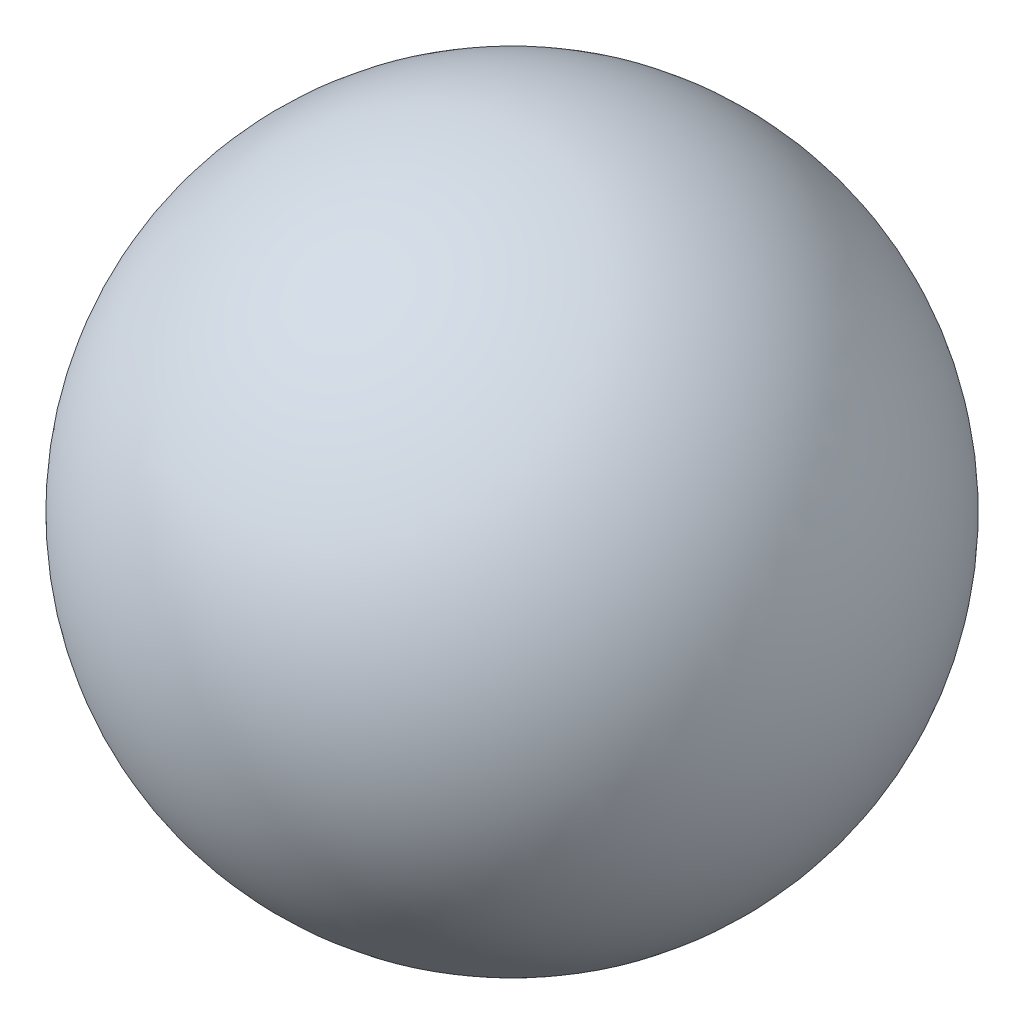
ISO-10303-21;
HEADER;
FILE_DESCRIPTION(('STEP AP214'),'2;1');
FILE_NAME('part.step','',(''),(''),'','','');
FILE_SCHEMA(('AUTOMOTIVE_DESIGN { 1 0 10303 214 1 1 1 1 }'));
ENDSEC;
DATA;
#1=APPLICATION_CONTEXT('core data for automotive mechanical design processes');
#2=APPLICATION_PROTOCOL_DEFINITION('international standard','automotive_design',2000,#1);
#3=PRODUCT_CONTEXT('',#1,'mechanical');
#4=PRODUCT('Part','Part','',(#3));
#5=PRODUCT_RELATED_PRODUCT_CATEGORY('part','',(#4));
#6=PRODUCT_DEFINITION_FORMATION('','',#4);
#7=PRODUCT_DEFINITION_CONTEXT('part definition',#1,'design');
#8=PRODUCT_DEFINITION('design','',#6,#7);
#9=PRODUCT_DEFINITION_SHAPE('','',#8);
#10=(LENGTH_UNIT() NAMED_UNIT(*) SI_UNIT(.MILLI.,.METRE.));
#11=(NAMED_UNIT(*) PLANE_ANGLE_UNIT() SI_UNIT($,.RADIAN.));
#12=(NAMED_UNIT(*) SI_UNIT($,.STERADIAN.) SOLID_ANGLE_UNIT());
#13=UNCERTAINTY_MEASURE_WITH_UNIT(LENGTH_MEASURE(1.E-05),#10,'distance_accuracy_value','');
#14=(GEOMETRIC_REPRESENTATION_CONTEXT(3) GLOBAL_UNCERTAINTY_ASSIGNED_CONTEXT((#13)) GLOBAL_UNIT_ASSIGNED_CONTEXT((#10,
#11,#12)) REPRESENTATION_CONTEXT('',''));
#15=CARTESIAN_POINT('',(0.,0.,0.));
#16=DIRECTION('',(0.,0.,1.));
#17=DIRECTION('',(1.,0.,0.));
#18=AXIS2_PLACEMENT_3D('',#15,#16,#17);
#19=CARTESIAN_POINT('',(0.,0.,0.));
#20=DIRECTION('',(0.,1.,0.));
#21=DIRECTION('',(1.,0.,0.));
#22=AXIS2_PLACEMENT_3D('',#19,#20,#21);
#23=SPHERICAL_SURFACE('',#22,11.);
#24=CARTESIAN_POINT('',(0.,11.,0.));
#25=VERTEX_POINT('',#24);
#26=VERTEX_LOOP('',#25);
#27=FACE_BOUND('',#26,.T.);
#28=ADVANCED_FACE('F36',(#27),#23,.T.);
#29=CLOSED_SHELL('',(#28));
#30=MANIFOLD_SOLID_BREP('B2',#29);
#31=ADVANCED_BREP_SHAPE_REPRESENTATION('',(#18,#30),#14);
#32=SHAPE_DEFINITION_REPRESENTATION(#9,#31);
ENDSEC;
END-ISO-10303-21;
